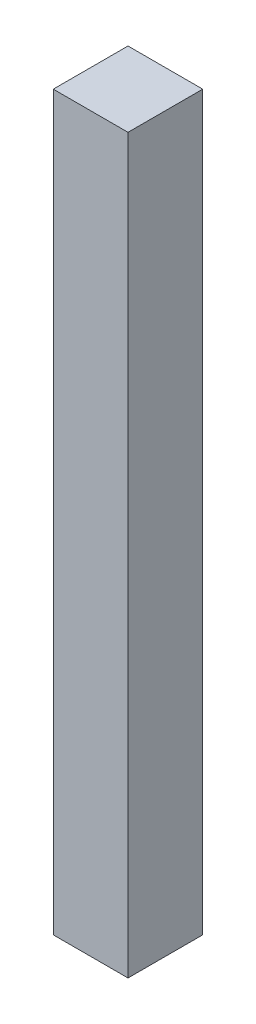
ISO-10303-21;
HEADER;
FILE_DESCRIPTION(('STEP AP214'),'2;1');
FILE_NAME('part.step','',(''),(''),'','','');
FILE_SCHEMA(('AUTOMOTIVE_DESIGN { 1 0 10303 214 1 1 1 1 }'));
ENDSEC;
DATA;
#1=APPLICATION_CONTEXT('core data for automotive mechanical design processes');
#2=APPLICATION_PROTOCOL_DEFINITION('international standard','automotive_design',2000,#1);
#3=PRODUCT_CONTEXT('',#1,'mechanical');
#4=PRODUCT('Part','Part','',(#3));
#5=PRODUCT_RELATED_PRODUCT_CATEGORY('part','',(#4));
#6=PRODUCT_DEFINITION_FORMATION('','',#4);
#7=PRODUCT_DEFINITION_CONTEXT('part definition',#1,'design');
#8=PRODUCT_DEFINITION('design','',#6,#7);
#9=PRODUCT_DEFINITION_SHAPE('','',#8);
#10=(LENGTH_UNIT() NAMED_UNIT(*) SI_UNIT(.MILLI.,.METRE.));
#11=(NAMED_UNIT(*) PLANE_ANGLE_UNIT() SI_UNIT($,.RADIAN.));
#12=(NAMED_UNIT(*) SI_UNIT($,.STERADIAN.) SOLID_ANGLE_UNIT());
#13=UNCERTAINTY_MEASURE_WITH_UNIT(LENGTH_MEASURE(1.E-05),#10,'distance_accuracy_value','');
#14=(GEOMETRIC_REPRESENTATION_CONTEXT(3) GLOBAL_UNCERTAINTY_ASSIGNED_CONTEXT((#13)) GLOBAL_UNIT_ASSIGNED_CONTEXT((#10,
#11,#12)) REPRESENTATION_CONTEXT('',''));
#15=CARTESIAN_POINT('',(0.,0.,0.));
#16=DIRECTION('',(0.,0.,1.));
#17=DIRECTION('',(1.,0.,0.));
#18=AXIS2_PLACEMENT_3D('',#15,#16,#17);
#19=CARTESIAN_POINT('',(49.9999999999999,490.,100.));
#20=DIRECTION('',(-1.,0.,0.));
#21=DIRECTION('',(0.,-1.,0.));
#22=AXIS2_PLACEMENT_3D('',#19,#20,#21);
#23=PLANE('',#22);
#24=DIRECTION('',(0.,1.,0.));
#25=VECTOR('',#24,1.);
#26=CARTESIAN_POINT('',(49.9999999999999,490.,0.));
#27=LINE('',#26,#25);
#28=CARTESIAN_POINT('',(50.0000000000001,-490.,0.));
#29=VERTEX_POINT('',#28);
#30=CARTESIAN_POINT('',(49.9999999999999,490.,0.));
#31=VERTEX_POINT('',#30);
#32=EDGE_CURVE('E96',#29,#31,#27,.T.);
#33=ORIENTED_EDGE('',*,*,#32,.T.);
#34=DIRECTION('',(0.,0.,-1.));
#35=VECTOR('',#34,1.);
#36=CARTESIAN_POINT('',(49.9999999999999,490.,100.));
#37=LINE('',#36,#35);
#38=CARTESIAN_POINT('',(49.9999999999999,490.,100.));
#39=VERTEX_POINT('',#38);
#40=EDGE_CURVE('E11',#39,#31,#37,.T.);
#41=ORIENTED_EDGE('',*,*,#40,.F.);
#42=DIRECTION('',(0.,1.,0.));
#43=VECTOR('',#42,1.);
#44=CARTESIAN_POINT('',(49.9999999999999,490.,100.));
#45=LINE('',#44,#43);
#46=CARTESIAN_POINT('',(50.0000000000001,-490.,100.));
#47=VERTEX_POINT('',#46);
#48=EDGE_CURVE('E84',#47,#39,#45,.T.);
#49=ORIENTED_EDGE('',*,*,#48,.F.);
#50=DIRECTION('',(0.,0.,-1.));
#51=VECTOR('',#50,1.);
#52=CARTESIAN_POINT('',(50.0000000000001,-490.,100.));
#53=LINE('',#52,#51);
#54=EDGE_CURVE('E92',#47,#29,#53,.T.);
#55=ORIENTED_EDGE('',*,*,#54,.T.);
#56=EDGE_LOOP('',(#33,#41,#49,#55));
#57=FACE_BOUND('',#56,.T.);
#58=ADVANCED_FACE('F33',(#57),#23,.F.);
#59=CARTESIAN_POINT('',(-50.0000000000001,490.,100.));
#60=DIRECTION('',(0.,-1.,0.));
#61=DIRECTION('',(0.,0.,-1.));
#62=AXIS2_PLACEMENT_3D('',#59,#60,#61);
#63=PLANE('',#62);
#64=DIRECTION('',(-1.,0.,0.));
#65=VECTOR('',#64,1.);
#66=CARTESIAN_POINT('',(-50.0000000000001,490.,0.));
#67=LINE('',#66,#65);
#68=CARTESIAN_POINT('',(-50.0000000000001,490.,0.));
#69=VERTEX_POINT('',#68);
#70=EDGE_CURVE('E88',#31,#69,#67,.T.);
#71=ORIENTED_EDGE('',*,*,#70,.T.);
#72=DIRECTION('',(0.,0.,-1.));
#73=VECTOR('',#72,1.);
#74=CARTESIAN_POINT('',(-50.0000000000001,490.,100.));
#75=LINE('',#74,#73);
#76=CARTESIAN_POINT('',(-50.0000000000001,490.,100.));
#77=VERTEX_POINT('',#76);
#78=EDGE_CURVE('E41',#77,#69,#75,.T.);
#79=ORIENTED_EDGE('',*,*,#78,.F.);
#80=DIRECTION('',(-1.,0.,0.));
#81=VECTOR('',#80,1.);
#82=CARTESIAN_POINT('',(-50.0000000000001,490.,100.));
#83=LINE('',#82,#81);
#84=EDGE_CURVE('E79',#39,#77,#83,.T.);
#85=ORIENTED_EDGE('',*,*,#84,.F.);
#86=ORIENTED_EDGE('',*,*,#40,.T.);
#87=EDGE_LOOP('',(#71,#79,#85,#86));
#88=FACE_BOUND('',#87,.T.);
#89=ADVANCED_FACE('F87',(#88),#63,.F.);
#90=CARTESIAN_POINT('',(-50.0000000000001,490.,100.));
#91=DIRECTION('',(1.,0.,0.));
#92=DIRECTION('',(0.,1.,0.));
#93=AXIS2_PLACEMENT_3D('',#90,#91,#92);
#94=PLANE('',#93);
#95=DIRECTION('',(0.,-1.,0.));
#96=VECTOR('',#95,1.);
#97=CARTESIAN_POINT('',(-50.0000000000001,490.,0.));
#98=LINE('',#97,#96);
#99=CARTESIAN_POINT('',(-50.,-490.,0.));
#100=VERTEX_POINT('',#99);
#101=EDGE_CURVE('E66',#69,#100,#98,.T.);
#102=ORIENTED_EDGE('',*,*,#101,.T.);
#103=DIRECTION('',(0.,0.,-1.));
#104=VECTOR('',#103,1.);
#105=CARTESIAN_POINT('',(-50.,-490.,100.));
#106=LINE('',#105,#104);
#107=CARTESIAN_POINT('',(-50.,-490.,100.));
#108=VERTEX_POINT('',#107);
#109=EDGE_CURVE('E89',#108,#100,#106,.T.);
#110=ORIENTED_EDGE('',*,*,#109,.F.);
#111=DIRECTION('',(0.,-1.,0.));
#112=VECTOR('',#111,1.);
#113=CARTESIAN_POINT('',(-50.0000000000001,490.,100.));
#114=LINE('',#113,#112);
#115=EDGE_CURVE('E82',#77,#108,#114,.T.);
#116=ORIENTED_EDGE('',*,*,#115,.F.);
#117=ORIENTED_EDGE('',*,*,#78,.T.);
#118=EDGE_LOOP('',(#102,#110,#116,#117));
#119=FACE_BOUND('',#118,.T.);
#120=ADVANCED_FACE('F90',(#119),#94,.F.);
#121=CARTESIAN_POINT('',(-50.,-490.,100.));
#122=DIRECTION('',(0.,1.,0.));
#123=DIRECTION('',(0.,0.,1.));
#124=AXIS2_PLACEMENT_3D('',#121,#122,#123);
#125=PLANE('',#124);
#126=DIRECTION('',(1.,0.,0.));
#127=VECTOR('',#126,1.);
#128=CARTESIAN_POINT('',(-50.,-490.,0.));
#129=LINE('',#128,#127);
#130=EDGE_CURVE('E72',#100,#29,#129,.T.);
#131=ORIENTED_EDGE('',*,*,#130,.T.);
#132=ORIENTED_EDGE('',*,*,#54,.F.);
#133=DIRECTION('',(1.,0.,0.));
#134=VECTOR('',#133,1.);
#135=CARTESIAN_POINT('',(-50.,-490.,100.));
#136=LINE('',#135,#134);
#137=EDGE_CURVE('E49',#108,#47,#136,.T.);
#138=ORIENTED_EDGE('',*,*,#137,.F.);
#139=ORIENTED_EDGE('',*,*,#109,.T.);
#140=EDGE_LOOP('',(#131,#132,#138,#139));
#141=FACE_BOUND('',#140,.T.);
#142=ADVANCED_FACE('F103',(#141),#125,.F.);
#143=CARTESIAN_POINT('',(0.,0.,100.));
#144=DIRECTION('',(0.,0.,1.));
#145=DIRECTION('',(1.,0.,0.));
#146=AXIS2_PLACEMENT_3D('',#143,#144,#145);
#147=PLANE('',#146);
#148=ORIENTED_EDGE('',*,*,#48,.T.);
#149=ORIENTED_EDGE('',*,*,#84,.T.);
#150=ORIENTED_EDGE('',*,*,#115,.T.);
#151=ORIENTED_EDGE('',*,*,#137,.T.);
#152=EDGE_LOOP('',(#148,#149,#150,#151));
#153=FACE_BOUND('',#152,.T.);
#154=ADVANCED_FACE('F80',(#153),#147,.T.);
#155=CARTESIAN_POINT('',(0.,0.,0.));
#156=DIRECTION('',(0.,0.,1.));
#157=DIRECTION('',(1.,0.,0.));
#158=AXIS2_PLACEMENT_3D('',#155,#156,#157);
#159=PLANE('',#158);
#160=ORIENTED_EDGE('',*,*,#32,.F.);
#161=ORIENTED_EDGE('',*,*,#130,.F.);
#162=ORIENTED_EDGE('',*,*,#101,.F.);
#163=ORIENTED_EDGE('',*,*,#70,.F.);
#164=EDGE_LOOP('',(#160,#161,#162,#163));
#165=FACE_BOUND('',#164,.T.);
#166=ADVANCED_FACE('F106',(#165),#159,.F.);
#167=CLOSED_SHELL('',(#58,#89,#120,#142,#154,#166));
#168=MANIFOLD_SOLID_BREP('B2',#167);
#169=ADVANCED_BREP_SHAPE_REPRESENTATION('',(#18,#168),#14);
#170=SHAPE_DEFINITION_REPRESENTATION(#9,#169);
ENDSEC;
END-ISO-10303-21;
